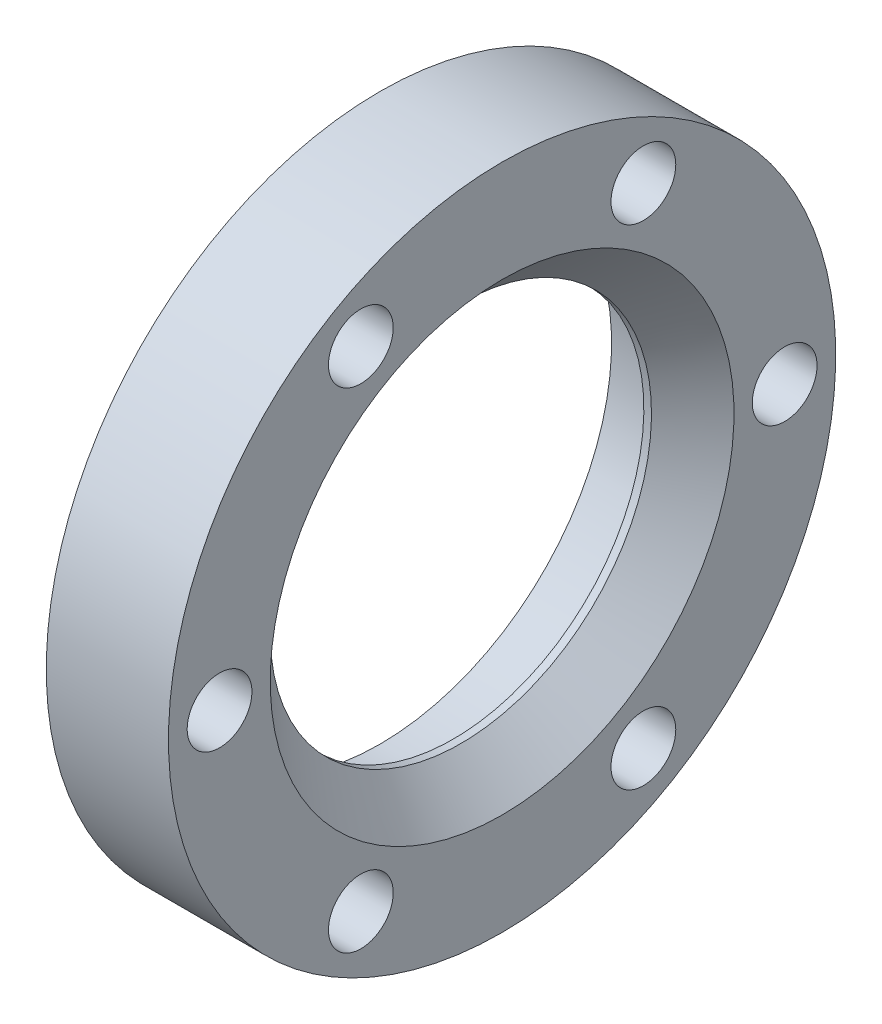
ISO-10303-21;
HEADER;
FILE_DESCRIPTION(('STEP AP214'),'2;1');
FILE_NAME('part.step','',(''),(''),'','','');
FILE_SCHEMA(('AUTOMOTIVE_DESIGN { 1 0 10303 214 1 1 1 1 }'));
ENDSEC;
DATA;
#1=APPLICATION_CONTEXT('core data for automotive mechanical design processes');
#2=APPLICATION_PROTOCOL_DEFINITION('international standard','automotive_design',2000,#1);
#3=PRODUCT_CONTEXT('',#1,'mechanical');
#4=PRODUCT('Part','Part','',(#3));
#5=PRODUCT_RELATED_PRODUCT_CATEGORY('part','',(#4));
#6=PRODUCT_DEFINITION_FORMATION('','',#4);
#7=PRODUCT_DEFINITION_CONTEXT('part definition',#1,'design');
#8=PRODUCT_DEFINITION('design','',#6,#7);
#9=PRODUCT_DEFINITION_SHAPE('','',#8);
#10=(LENGTH_UNIT() NAMED_UNIT(*) SI_UNIT(.MILLI.,.METRE.));
#11=(NAMED_UNIT(*) PLANE_ANGLE_UNIT() SI_UNIT($,.RADIAN.));
#12=(NAMED_UNIT(*) SI_UNIT($,.STERADIAN.) SOLID_ANGLE_UNIT());
#13=UNCERTAINTY_MEASURE_WITH_UNIT(LENGTH_MEASURE(1.E-05),#10,'distance_accuracy_value','');
#14=(GEOMETRIC_REPRESENTATION_CONTEXT(3) GLOBAL_UNCERTAINTY_ASSIGNED_CONTEXT((#13)) GLOBAL_UNIT_ASSIGNED_CONTEXT((#10,
#11,#12)) REPRESENTATION_CONTEXT('',''));
#15=CARTESIAN_POINT('',(0.,0.,0.));
#16=DIRECTION('',(0.,0.,1.));
#17=DIRECTION('',(1.,0.,0.));
#18=AXIS2_PLACEMENT_3D('',#15,#16,#17);
#19=CARTESIAN_POINT('',(8.01687499999896,0.,0.));
#20=DIRECTION('',(1.,0.,0.));
#21=DIRECTION('',(0.,1.,0.));
#22=AXIS2_PLACEMENT_3D('',#19,#20,#21);
#23=CYLINDRICAL_SURFACE('',#22,19.8120000000008);
#24=CARTESIAN_POINT('',(8.41374999807562,0.,0.));
#25=DIRECTION('',(1.,0.,0.));
#26=DIRECTION('',(0.,1.,0.));
#27=AXIS2_PLACEMENT_3D('',#24,#25,#26);
#28=CIRCLE('',#27,19.8120000019241);
#29=CARTESIAN_POINT('',(8.41374999807565,19.8120000019241,0.));
#30=VERTEX_POINT('',#29);
#31=EDGE_CURVE('E75',#30,#30,#28,.T.);
#32=ORIENTED_EDGE('',*,*,#31,.T.);
#33=EDGE_LOOP('',(#32));
#34=FACE_BOUND('',#33,.T.);
#35=CARTESIAN_POINT('',(7.61999999999895,0.,0.));
#36=DIRECTION('',(1.,0.,0.));
#37=DIRECTION('',(0.,1.,0.));
#38=AXIS2_PLACEMENT_3D('',#35,#36,#37);
#39=CIRCLE('',#38,19.8120000000008);
#40=CARTESIAN_POINT('',(7.61999999999898,19.8120000000008,0.));
#41=VERTEX_POINT('',#40);
#42=EDGE_CURVE('E18',#41,#41,#39,.T.);
#43=ORIENTED_EDGE('',*,*,#42,.F.);
#44=EDGE_LOOP('',(#43));
#45=FACE_BOUND('',#44,.T.);
#46=ADVANCED_FACE('F14',(#34,#45),#23,.F.);
#47=CARTESIAN_POINT('',(7.61999999999898,21.9437000000006,0.));
#48=DIRECTION('',(-1.,0.,0.));
#49=DIRECTION('',(0.,0.,1.));
#50=AXIS2_PLACEMENT_3D('',#47,#48,#49);
#51=PLANE('',#50);
#52=ORIENTED_EDGE('',*,*,#42,.T.);
#53=EDGE_LOOP('',(#52));
#54=FACE_BOUND('',#53,.T.);
#55=CARTESIAN_POINT('',(7.61999999999894,0.,0.));
#56=DIRECTION('',(1.,0.,0.));
#57=DIRECTION('',(0.,1.,0.));
#58=AXIS2_PLACEMENT_3D('',#55,#56,#57);
#59=CIRCLE('',#58,24.0754000000004);
#60=CARTESIAN_POINT('',(7.61999999999898,24.0754000000004,0.));
#61=VERTEX_POINT('',#60);
#62=EDGE_CURVE('E73',#61,#61,#59,.F.);
#63=ORIENTED_EDGE('',*,*,#62,.T.);
#64=EDGE_LOOP('',(#63));
#65=FACE_BOUND('',#64,.T.);
#66=ADVANCED_FACE('F84',(#54,#65),#51,.T.);
#67=CARTESIAN_POINT('',(12.7000000019235,0.,0.));
#68=DIRECTION('',(1.,0.,0.));
#69=DIRECTION('',(0.,1.,0.));
#70=AXIS2_PLACEMENT_3D('',#67,#68,#69);
#71=CONICAL_SURFACE('',#70,24.0982499980792,0.78539816250007);
#72=CARTESIAN_POINT('',(12.7000000019235,0.,0.));
#73=DIRECTION('',(1.,0.,0.));
#74=DIRECTION('',(0.,1.,0.));
#75=AXIS2_PLACEMENT_3D('',#72,#73,#74);
#76=CIRCLE('',#75,24.0982499980792);
#77=CARTESIAN_POINT('',(12.7000000019235,24.0982499980792,0.));
#78=VERTEX_POINT('',#77);
#79=EDGE_CURVE('E53',#78,#78,#76,.F.);
#80=ORIENTED_EDGE('',*,*,#79,.F.);
#81=EDGE_LOOP('',(#80));
#82=FACE_BOUND('',#81,.T.);
#83=ORIENTED_EDGE('',*,*,#31,.F.);
#84=EDGE_LOOP('',(#83));
#85=FACE_BOUND('',#84,.T.);
#86=ADVANCED_FACE('F94',(#82,#85),#71,.F.);
#87=CARTESIAN_POINT('',(1.240785174E-13,25.4285843160802,-14.6812));
#88=DIRECTION('',(1.,0.,0.));
#89=DIRECTION('',(0.,0.,-1.));
#90=AXIS2_PLACEMENT_3D('',#87,#88,#89);
#91=CYLINDRICAL_SURFACE('',#90,3.36549999999999);
#92=CARTESIAN_POINT('',(1.35358378E-13,25.4285843160802,-14.6812));
#93=DIRECTION('',(1.,0.,0.));
#94=DIRECTION('',(0.,0.,-1.));
#95=AXIS2_PLACEMENT_3D('',#92,#93,#94);
#96=CIRCLE('',#95,3.36549999999999);
#97=CARTESIAN_POINT('',(1.32693040020406E-13,25.4285843160802,-18.0467));
#98=VERTEX_POINT('',#97);
#99=EDGE_CURVE('E50',#98,#98,#96,.T.);
#100=ORIENTED_EDGE('',*,*,#99,.F.);
#101=EDGE_LOOP('',(#100));
#102=FACE_BOUND('',#101,.T.);
#103=CARTESIAN_POINT('',(12.7000000000002,25.4285843160802,-14.6812));
#104=DIRECTION('',(1.,0.,0.));
#105=DIRECTION('',(0.,0.,-1.));
#106=AXIS2_PLACEMENT_3D('',#103,#104,#105);
#107=CIRCLE('',#106,3.36549999999999);
#108=CARTESIAN_POINT('',(12.7000000000002,25.4285843160802,-18.0467));
#109=VERTEX_POINT('',#108);
#110=EDGE_CURVE('E71',#109,#109,#107,.F.);
#111=ORIENTED_EDGE('',*,*,#110,.F.);
#112=EDGE_LOOP('',(#111));
#113=FACE_BOUND('',#112,.T.);
#114=ADVANCED_FACE('F118',(#102,#113),#91,.F.);
#115=CARTESIAN_POINT('',(0.,0.,-29.3624));
#116=DIRECTION('',(1.,0.,0.));
#117=DIRECTION('',(0.,1.,0.));
#118=AXIS2_PLACEMENT_3D('',#115,#116,#117);
#119=CYLINDRICAL_SURFACE('',#118,3.3655);
#120=CARTESIAN_POINT('',(1.35358378E-13,0.,-29.3624));
#121=DIRECTION('',(1.,0.,0.));
#122=DIRECTION('',(0.,1.,0.));
#123=AXIS2_PLACEMENT_3D('',#120,#121,#122);
#124=CIRCLE('',#123,3.3655);
#125=CARTESIAN_POINT('',(1.414547082E-13,3.3655,-29.3624));
#126=VERTEX_POINT('',#125);
#127=EDGE_CURVE('E47',#126,#126,#124,.T.);
#128=ORIENTED_EDGE('',*,*,#127,.F.);
#129=EDGE_LOOP('',(#128));
#130=FACE_BOUND('',#129,.T.);
#131=CARTESIAN_POINT('',(12.7000000000002,0.,-29.3624));
#132=DIRECTION('',(1.,0.,0.));
#133=DIRECTION('',(0.,1.,0.));
#134=AXIS2_PLACEMENT_3D('',#131,#132,#133);
#135=CIRCLE('',#134,3.3655);
#136=CARTESIAN_POINT('',(12.7000000000002,3.36549999999998,-29.3624));
#137=VERTEX_POINT('',#136);
#138=EDGE_CURVE('E68',#137,#137,#135,.F.);
#139=ORIENTED_EDGE('',*,*,#138,.F.);
#140=EDGE_LOOP('',(#139));
#141=FACE_BOUND('',#140,.T.);
#142=ADVANCED_FACE('F124',(#130,#141),#119,.F.);
#143=CARTESIAN_POINT('',(0.,-25.4285843160802,-14.6812));
#144=DIRECTION('',(1.,0.,0.));
#145=DIRECTION('',(0.,0.,-1.));
#146=AXIS2_PLACEMENT_3D('',#143,#144,#145);
#147=CYLINDRICAL_SURFACE('',#146,3.36549999999999);
#148=CARTESIAN_POINT('',(1.35358378E-13,-25.4285843160802,-14.6812));
#149=DIRECTION('',(1.,0.,0.));
#150=DIRECTION('',(0.,0.,-1.));
#151=AXIS2_PLACEMENT_3D('',#148,#149,#150);
#152=CIRCLE('',#151,3.36549999999999);
#153=CARTESIAN_POINT('',(1.38023707180776E-13,-25.4285843160802,-18.0467));
#154=VERTEX_POINT('',#153);
#155=EDGE_CURVE('E44',#154,#154,#152,.T.);
#156=ORIENTED_EDGE('',*,*,#155,.F.);
#157=EDGE_LOOP('',(#156));
#158=FACE_BOUND('',#157,.T.);
#159=CARTESIAN_POINT('',(12.7000000000002,-25.4285843160802,-14.6812));
#160=DIRECTION('',(1.,0.,0.));
#161=DIRECTION('',(0.,0.,-1.));
#162=AXIS2_PLACEMENT_3D('',#159,#160,#161);
#163=CIRCLE('',#162,3.36549999999999);
#164=CARTESIAN_POINT('',(12.7000000000002,-25.4285843160802,-18.0467));
#165=VERTEX_POINT('',#164);
#166=EDGE_CURVE('E65',#165,#165,#163,.F.);
#167=ORIENTED_EDGE('',*,*,#166,.F.);
#168=EDGE_LOOP('',(#167));
#169=FACE_BOUND('',#168,.T.);
#170=ADVANCED_FACE('F145',(#158,#169),#147,.F.);
#171=CARTESIAN_POINT('',(0.,-25.4285843160802,14.6812));
#172=DIRECTION('',(1.,0.,0.));
#173=DIRECTION('',(0.,0.,-1.));
#174=AXIS2_PLACEMENT_3D('',#171,#172,#173);
#175=CYLINDRICAL_SURFACE('',#174,3.36549999999999);
#176=CARTESIAN_POINT('',(1.35358378E-13,-25.4285843160802,14.6812));
#177=DIRECTION('',(1.,0.,0.));
#178=DIRECTION('',(0.,0.,-1.));
#179=AXIS2_PLACEMENT_3D('',#176,#177,#178);
#180=CIRCLE('',#179,3.36549999999999);
#181=CARTESIAN_POINT('',(1.32795231693552E-13,-25.4285843160802,11.3157));
#182=VERTEX_POINT('',#181);
#183=EDGE_CURVE('E41',#182,#182,#180,.T.);
#184=ORIENTED_EDGE('',*,*,#183,.F.);
#185=EDGE_LOOP('',(#184));
#186=FACE_BOUND('',#185,.T.);
#187=CARTESIAN_POINT('',(12.7000000000002,-25.4285843160802,14.6812));
#188=DIRECTION('',(1.,0.,0.));
#189=DIRECTION('',(0.,0.,-1.));
#190=AXIS2_PLACEMENT_3D('',#187,#188,#189);
#191=CIRCLE('',#190,3.36549999999999);
#192=CARTESIAN_POINT('',(12.7000000000002,-25.4285843160802,11.3157));
#193=VERTEX_POINT('',#192);
#194=EDGE_CURVE('E62',#193,#193,#191,.F.);
#195=ORIENTED_EDGE('',*,*,#194,.F.);
#196=EDGE_LOOP('',(#195));
#197=FACE_BOUND('',#196,.T.);
#198=ADVANCED_FACE('F152',(#186,#197),#175,.F.);
#199=CARTESIAN_POINT('',(1.240785174E-13,25.4285843160802,14.6812));
#200=DIRECTION('',(1.,0.,0.));
#201=DIRECTION('',(0.,0.,-1.));
#202=AXIS2_PLACEMENT_3D('',#199,#200,#201);
#203=CYLINDRICAL_SURFACE('',#202,3.36549999999999);
#204=CARTESIAN_POINT('',(1.35358378E-13,25.4285843160802,14.6812));
#205=DIRECTION('',(1.,0.,0.));
#206=DIRECTION('',(0.,0.,-1.));
#207=AXIS2_PLACEMENT_3D('',#204,#205,#206);
#208=CIRCLE('',#207,3.36549999999999);
#209=CARTESIAN_POINT('',(1.37921517707334E-13,25.4285843160802,11.3157));
#210=VERTEX_POINT('',#209);
#211=EDGE_CURVE('E38',#210,#210,#208,.T.);
#212=ORIENTED_EDGE('',*,*,#211,.F.);
#213=EDGE_LOOP('',(#212));
#214=FACE_BOUND('',#213,.T.);
#215=CARTESIAN_POINT('',(12.7000000000002,25.4285843160802,14.6812));
#216=DIRECTION('',(1.,0.,0.));
#217=DIRECTION('',(0.,0.,-1.));
#218=AXIS2_PLACEMENT_3D('',#215,#216,#217);
#219=CIRCLE('',#218,3.36549999999999);
#220=CARTESIAN_POINT('',(12.7000000000002,25.4285843160802,11.3157));
#221=VERTEX_POINT('',#220);
#222=EDGE_CURVE('E59',#221,#221,#219,.F.);
#223=ORIENTED_EDGE('',*,*,#222,.F.);
#224=EDGE_LOOP('',(#223));
#225=FACE_BOUND('',#224,.T.);
#226=ADVANCED_FACE('F158',(#214,#225),#203,.F.);
#227=CARTESIAN_POINT('',(0.,0.,29.3624));
#228=DIRECTION('',(1.,0.,0.));
#229=DIRECTION('',(0.,1.,0.));
#230=AXIS2_PLACEMENT_3D('',#227,#228,#229);
#231=CYLINDRICAL_SURFACE('',#230,3.3655);
#232=CARTESIAN_POINT('',(1.35358378E-13,0.,29.3624));
#233=DIRECTION('',(1.,0.,0.));
#234=DIRECTION('',(0.,1.,0.));
#235=AXIS2_PLACEMENT_3D('',#232,#233,#234);
#236=CIRCLE('',#235,3.3655);
#237=CARTESIAN_POINT('',(1.413366998E-13,3.3655,29.3624));
#238=VERTEX_POINT('',#237);
#239=EDGE_CURVE('E35',#238,#238,#236,.T.);
#240=ORIENTED_EDGE('',*,*,#239,.F.);
#241=EDGE_LOOP('',(#240));
#242=FACE_BOUND('',#241,.T.);
#243=CARTESIAN_POINT('',(12.7000000000002,0.,29.3624));
#244=DIRECTION('',(1.,0.,0.));
#245=DIRECTION('',(0.,1.,0.));
#246=AXIS2_PLACEMENT_3D('',#243,#244,#245);
#247=CIRCLE('',#246,3.3655);
#248=CARTESIAN_POINT('',(12.7000000000002,3.36549999999998,29.3624));
#249=VERTEX_POINT('',#248);
#250=EDGE_CURVE('E56',#249,#249,#247,.F.);
#251=ORIENTED_EDGE('',*,*,#250,.F.);
#252=EDGE_LOOP('',(#251));
#253=FACE_BOUND('',#252,.T.);
#254=ADVANCED_FACE('F16',(#242,#253),#231,.F.);
#255=CARTESIAN_POINT('',(3.80999999999952,0.,0.));
#256=DIRECTION('',(1.,0.,0.));
#257=DIRECTION('',(0.,1.,0.));
#258=AXIS2_PLACEMENT_3D('',#255,#256,#257);
#259=CYLINDRICAL_SURFACE('',#258,24.0754000000004);
#260=ORIENTED_EDGE('',*,*,#62,.F.);
#261=EDGE_LOOP('',(#260));
#262=FACE_BOUND('',#261,.T.);
#263=CARTESIAN_POINT('',(0.,0.,0.));
#264=DIRECTION('',(1.,0.,0.));
#265=DIRECTION('',(0.,1.,0.));
#266=AXIS2_PLACEMENT_3D('',#263,#264,#265);
#267=CIRCLE('',#266,24.0754000000004);
#268=CARTESIAN_POINT('',(1.35140530413566E-13,24.0754000000004,0.));
#269=VERTEX_POINT('',#268);
#270=EDGE_CURVE('E27',#269,#269,#267,.T.);
#271=ORIENTED_EDGE('',*,*,#270,.F.);
#272=EDGE_LOOP('',(#271));
#273=FACE_BOUND('',#272,.T.);
#274=ADVANCED_FACE('F112',(#262,#273),#259,.F.);
#275=CARTESIAN_POINT('',(12.7000000000002,29.3846250000013,0.));
#276=DIRECTION('',(1.,0.,0.));
#277=DIRECTION('',(0.,0.,-1.));
#278=AXIS2_PLACEMENT_3D('',#275,#276,#277);
#279=PLANE('',#278);
#280=ORIENTED_EDGE('',*,*,#79,.T.);
#281=EDGE_LOOP('',(#280));
#282=FACE_BOUND('',#281,.T.);
#283=ORIENTED_EDGE('',*,*,#250,.T.);
#284=EDGE_LOOP('',(#283));
#285=FACE_BOUND('',#284,.T.);
#286=ORIENTED_EDGE('',*,*,#222,.T.);
#287=EDGE_LOOP('',(#286));
#288=FACE_BOUND('',#287,.T.);
#289=ORIENTED_EDGE('',*,*,#194,.T.);
#290=EDGE_LOOP('',(#289));
#291=FACE_BOUND('',#290,.T.);
#292=ORIENTED_EDGE('',*,*,#166,.T.);
#293=EDGE_LOOP('',(#292));
#294=FACE_BOUND('',#293,.T.);
#295=ORIENTED_EDGE('',*,*,#138,.T.);
#296=EDGE_LOOP('',(#295));
#297=FACE_BOUND('',#296,.T.);
#298=ORIENTED_EDGE('',*,*,#110,.T.);
#299=EDGE_LOOP('',(#298));
#300=FACE_BOUND('',#299,.T.);
#301=CARTESIAN_POINT('',(12.7000000000001,0.,0.));
#302=DIRECTION('',(1.,0.,0.));
#303=DIRECTION('',(0.,1.,0.));
#304=AXIS2_PLACEMENT_3D('',#301,#302,#303);
#305=CIRCLE('',#304,34.6710000000002);
#306=CARTESIAN_POINT('',(12.7000000000002,34.6710000000002,0.));
#307=VERTEX_POINT('',#306);
#308=EDGE_CURVE('E22',#307,#307,#305,.F.);
#309=ORIENTED_EDGE('',*,*,#308,.F.);
#310=EDGE_LOOP('',(#309));
#311=FACE_BOUND('',#310,.T.);
#312=ADVANCED_FACE('F105',(#282,#285,#288,#291,#294,#297,#300,#311),#279,.T.);
#313=CARTESIAN_POINT('',(1.35358378E-13,29.3732000000003,0.));
#314=DIRECTION('',(-1.,0.,0.));
#315=DIRECTION('',(0.,0.,1.));
#316=AXIS2_PLACEMENT_3D('',#313,#314,#315);
#317=PLANE('',#316);
#318=ORIENTED_EDGE('',*,*,#270,.T.);
#319=EDGE_LOOP('',(#318));
#320=FACE_BOUND('',#319,.T.);
#321=ORIENTED_EDGE('',*,*,#239,.T.);
#322=EDGE_LOOP('',(#321));
#323=FACE_BOUND('',#322,.T.);
#324=ORIENTED_EDGE('',*,*,#211,.T.);
#325=EDGE_LOOP('',(#324));
#326=FACE_BOUND('',#325,.T.);
#327=ORIENTED_EDGE('',*,*,#183,.T.);
#328=EDGE_LOOP('',(#327));
#329=FACE_BOUND('',#328,.T.);
#330=ORIENTED_EDGE('',*,*,#155,.T.);
#331=EDGE_LOOP('',(#330));
#332=FACE_BOUND('',#331,.T.);
#333=ORIENTED_EDGE('',*,*,#127,.T.);
#334=EDGE_LOOP('',(#333));
#335=FACE_BOUND('',#334,.T.);
#336=ORIENTED_EDGE('',*,*,#99,.T.);
#337=EDGE_LOOP('',(#336));
#338=FACE_BOUND('',#337,.T.);
#339=CARTESIAN_POINT('',(0.,0.,0.));
#340=DIRECTION('',(1.,0.,0.));
#341=DIRECTION('',(0.,1.,0.));
#342=AXIS2_PLACEMENT_3D('',#339,#340,#341);
#343=CIRCLE('',#342,34.6710000000002);
#344=CARTESIAN_POINT('',(1.35313821276015E-13,34.6710000000002,0.));
#345=VERTEX_POINT('',#344);
#346=EDGE_CURVE('E10',#345,#345,#343,.T.);
#347=ORIENTED_EDGE('',*,*,#346,.F.);
#348=EDGE_LOOP('',(#347));
#349=FACE_BOUND('',#348,.T.);
#350=ADVANCED_FACE('F99',(#320,#323,#326,#329,#332,#335,#338,#349),#317,.T.);
#351=CARTESIAN_POINT('',(6.3500000000001,0.,0.));
#352=DIRECTION('',(1.,0.,0.));
#353=DIRECTION('',(0.,1.,0.));
#354=AXIS2_PLACEMENT_3D('',#351,#352,#353);
#355=CYLINDRICAL_SURFACE('',#354,34.6710000000002);
#356=ORIENTED_EDGE('',*,*,#346,.T.);
#357=EDGE_LOOP('',(#356));
#358=FACE_BOUND('',#357,.T.);
#359=ORIENTED_EDGE('',*,*,#308,.T.);
#360=EDGE_LOOP('',(#359));
#361=FACE_BOUND('',#360,.T.);
#362=ADVANCED_FACE('F97',(#358,#361),#355,.T.);
#363=CLOSED_SHELL('',(#46,#66,#86,#114,#142,#170,#198,#226,#254,#274,#312,#350,#362));
#364=MANIFOLD_SOLID_BREP('B1',#363);
#365=ADVANCED_BREP_SHAPE_REPRESENTATION('',(#18,#364),#14);
#366=SHAPE_DEFINITION_REPRESENTATION(#9,#365);
ENDSEC;
END-ISO-10303-21;
